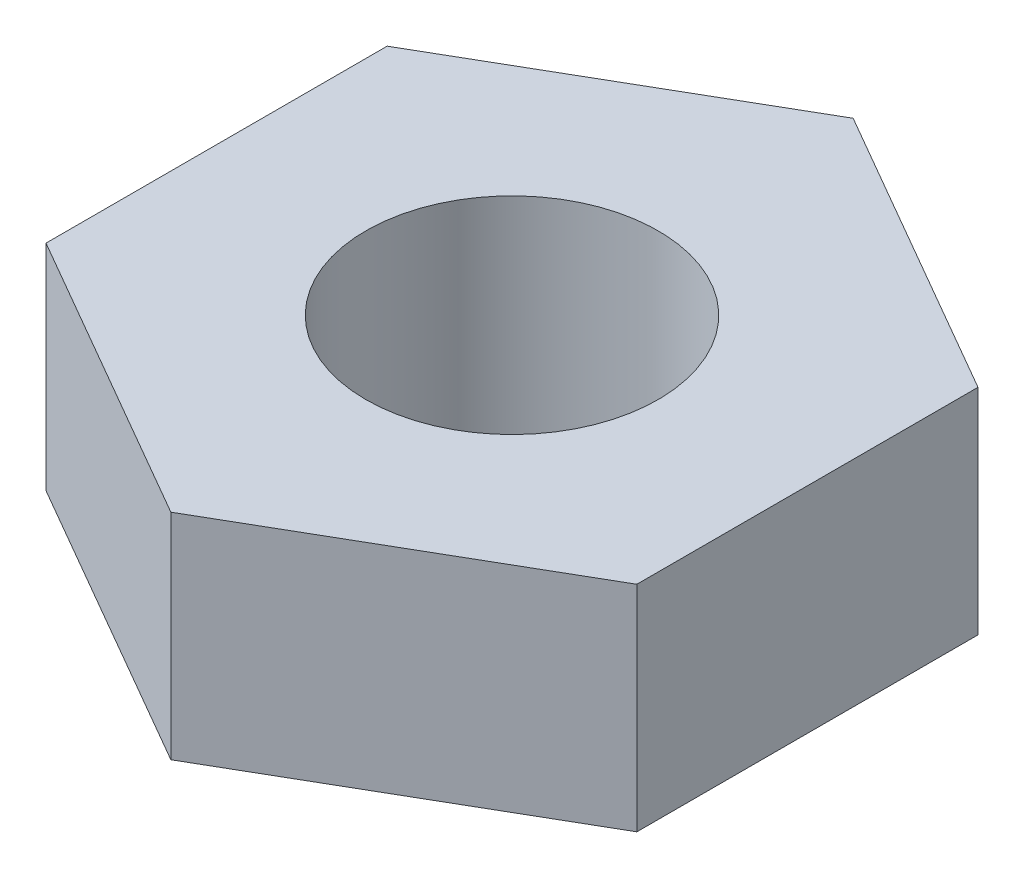
ISO-10303-21;
HEADER;
FILE_DESCRIPTION(('STEP AP214'),'2;1');
FILE_NAME('part.step','',(''),(''),'','','');
FILE_SCHEMA(('AUTOMOTIVE_DESIGN { 1 0 10303 214 1 1 1 1 }'));
ENDSEC;
DATA;
#1=APPLICATION_CONTEXT('core data for automotive mechanical design processes');
#2=APPLICATION_PROTOCOL_DEFINITION('international standard','automotive_design',2000,#1);
#3=PRODUCT_CONTEXT('',#1,'mechanical');
#4=PRODUCT('Part','Part','',(#3));
#5=PRODUCT_RELATED_PRODUCT_CATEGORY('part','',(#4));
#6=PRODUCT_DEFINITION_FORMATION('','',#4);
#7=PRODUCT_DEFINITION_CONTEXT('part definition',#1,'design');
#8=PRODUCT_DEFINITION('design','',#6,#7);
#9=PRODUCT_DEFINITION_SHAPE('','',#8);
#10=(LENGTH_UNIT() NAMED_UNIT(*) SI_UNIT(.MILLI.,.METRE.));
#11=(NAMED_UNIT(*) PLANE_ANGLE_UNIT() SI_UNIT($,.RADIAN.));
#12=(NAMED_UNIT(*) SI_UNIT($,.STERADIAN.) SOLID_ANGLE_UNIT());
#13=UNCERTAINTY_MEASURE_WITH_UNIT(LENGTH_MEASURE(1.E-05),#10,'distance_accuracy_value','');
#14=(GEOMETRIC_REPRESENTATION_CONTEXT(3) GLOBAL_UNCERTAINTY_ASSIGNED_CONTEXT((#13)) GLOBAL_UNIT_ASSIGNED_CONTEXT((#10,
#11,#12)) REPRESENTATION_CONTEXT('',''));
#15=CARTESIAN_POINT('',(0.,0.,0.));
#16=DIRECTION('',(0.,0.,1.));
#17=DIRECTION('',(1.,0.,0.));
#18=AXIS2_PLACEMENT_3D('',#15,#16,#17);
#19=CARTESIAN_POINT('',(-11.9500009809813,12.1,-11.0446978763615));
#20=DIRECTION('',(0.,1.,0.));
#21=DIRECTION('',(0.,0.,1.));
#22=AXIS2_PLACEMENT_3D('',#19,#20,#21);
#23=PLANE('',#22);
#24=DIRECTION('',(0.866025403784438,0.,-0.5));
#25=VECTOR('',#24,1.);
#26=CARTESIAN_POINT('',(-13.277778867757,12.1,-8.77188652929051));
#27=LINE('',#26,#25);
#28=CARTESIAN_POINT('',(-13.277778867757,12.1,-8.77188652929051));
#29=VERTEX_POINT('',#28);
#30=CARTESIAN_POINT('',(-10.2466899545114,12.1,-10.5218865292905));
#31=VERTEX_POINT('',#30);
#32=EDGE_CURVE('E132',#29,#31,#27,.T.);
#33=ORIENTED_EDGE('',*,*,#32,.T.);
#34=DIRECTION('',(0.,0.,-1.));
#35=VECTOR('',#34,1.);
#36=CARTESIAN_POINT('',(-10.2466899545114,12.1,-10.5218865292905));
#37=LINE('',#36,#35);
#38=CARTESIAN_POINT('',(-10.2466899545114,12.1,-14.0218865292905));
#39=VERTEX_POINT('',#38);
#40=EDGE_CURVE('E90',#31,#39,#37,.T.);
#41=ORIENTED_EDGE('',*,*,#40,.T.);
#42=DIRECTION('',(-0.866025403784439,0.,-0.5));
#43=VECTOR('',#42,1.);
#44=CARTESIAN_POINT('',(-10.2466899545114,12.1,-14.0218865292905));
#45=LINE('',#44,#43);
#46=CARTESIAN_POINT('',(-13.277778867757,12.1,-15.7718865292905));
#47=VERTEX_POINT('',#46);
#48=EDGE_CURVE('E103',#39,#47,#45,.T.);
#49=ORIENTED_EDGE('',*,*,#48,.T.);
#50=DIRECTION('',(-0.866025403784438,0.,0.5));
#51=VECTOR('',#50,1.);
#52=CARTESIAN_POINT('',(-13.277778867757,12.1,-15.7718865292905));
#53=LINE('',#52,#51);
#54=CARTESIAN_POINT('',(-16.3088677810025,12.1,-14.0218865292905));
#55=VERTEX_POINT('',#54);
#56=EDGE_CURVE('E97',#47,#55,#53,.T.);
#57=ORIENTED_EDGE('',*,*,#56,.T.);
#58=DIRECTION('',(0.,0.,1.));
#59=VECTOR('',#58,1.);
#60=CARTESIAN_POINT('',(-16.3088677810025,12.1,-14.0218865292905));
#61=LINE('',#60,#59);
#62=CARTESIAN_POINT('',(-16.3088677810025,12.1,-10.5218865292905));
#63=VERTEX_POINT('',#62);
#64=EDGE_CURVE('E101',#55,#63,#61,.T.);
#65=ORIENTED_EDGE('',*,*,#64,.T.);
#66=DIRECTION('',(0.866025403784439,0.,0.5));
#67=VECTOR('',#66,1.);
#68=CARTESIAN_POINT('',(-16.3088677810025,12.1,-10.5218865292905));
#69=LINE('',#68,#67);
#70=EDGE_CURVE('E53',#63,#29,#69,.T.);
#71=ORIENTED_EDGE('',*,*,#70,.T.);
#72=EDGE_LOOP('',(#33,#41,#49,#57,#65,#71));
#73=FACE_BOUND('',#72,.T.);
#74=CARTESIAN_POINT('',(-13.277778867757,12.1,-12.2718865292905));
#75=DIRECTION('',(0.,1.,0.));
#76=DIRECTION('',(0.,0.,1.));
#77=AXIS2_PLACEMENT_3D('',#74,#75,#76);
#78=CIRCLE('',#77,1.5);
#79=CARTESIAN_POINT('',(-13.277778867757,12.1,-10.7718865292905));
#80=VERTEX_POINT('',#79);
#81=EDGE_CURVE('E125',#80,#80,#78,.T.);
#82=ORIENTED_EDGE('',*,*,#81,.F.);
#83=EDGE_LOOP('',(#82));
#84=FACE_BOUND('',#83,.T.);
#85=ADVANCED_FACE('F36',(#73,#84),#23,.T.);
#86=CARTESIAN_POINT('',(-11.9500009809813,9.9,-11.0446978763615));
#87=DIRECTION('',(0.,1.,0.));
#88=DIRECTION('',(0.,0.,1.));
#89=AXIS2_PLACEMENT_3D('',#86,#87,#88);
#90=PLANE('',#89);
#91=DIRECTION('',(0.866025403784438,0.,-0.5));
#92=VECTOR('',#91,1.);
#93=CARTESIAN_POINT('',(-13.277778867757,9.9,-8.77188652929051));
#94=LINE('',#93,#92);
#95=CARTESIAN_POINT('',(-13.277778867757,9.9,-8.77188652929051));
#96=VERTEX_POINT('',#95);
#97=CARTESIAN_POINT('',(-10.2466899545114,9.9,-10.5218865292905));
#98=VERTEX_POINT('',#97);
#99=EDGE_CURVE('E121',#96,#98,#94,.T.);
#100=ORIENTED_EDGE('',*,*,#99,.F.);
#101=DIRECTION('',(0.866025403784439,0.,0.5));
#102=VECTOR('',#101,1.);
#103=CARTESIAN_POINT('',(-16.3088677810025,9.9,-10.5218865292905));
#104=LINE('',#103,#102);
#105=CARTESIAN_POINT('',(-16.3088677810025,9.9,-10.5218865292905));
#106=VERTEX_POINT('',#105);
#107=EDGE_CURVE('E82',#106,#96,#104,.T.);
#108=ORIENTED_EDGE('',*,*,#107,.F.);
#109=DIRECTION('',(0.,0.,1.));
#110=VECTOR('',#109,1.);
#111=CARTESIAN_POINT('',(-16.3088677810025,9.9,-14.0218865292905));
#112=LINE('',#111,#110);
#113=CARTESIAN_POINT('',(-16.3088677810025,9.9,-14.0218865292905));
#114=VERTEX_POINT('',#113);
#115=EDGE_CURVE('E76',#114,#106,#112,.T.);
#116=ORIENTED_EDGE('',*,*,#115,.F.);
#117=DIRECTION('',(-0.866025403784438,0.,0.5));
#118=VECTOR('',#117,1.);
#119=CARTESIAN_POINT('',(-13.277778867757,9.9,-15.7718865292905));
#120=LINE('',#119,#118);
#121=CARTESIAN_POINT('',(-13.277778867757,9.9,-15.7718865292905));
#122=VERTEX_POINT('',#121);
#123=EDGE_CURVE('E111',#122,#114,#120,.T.);
#124=ORIENTED_EDGE('',*,*,#123,.F.);
#125=DIRECTION('',(-0.866025403784439,0.,-0.5));
#126=VECTOR('',#125,1.);
#127=CARTESIAN_POINT('',(-10.2466899545114,9.9,-14.0218865292905));
#128=LINE('',#127,#126);
#129=CARTESIAN_POINT('',(-10.2466899545114,9.9,-14.0218865292905));
#130=VERTEX_POINT('',#129);
#131=EDGE_CURVE('E127',#130,#122,#128,.T.);
#132=ORIENTED_EDGE('',*,*,#131,.F.);
#133=DIRECTION('',(0.,0.,-1.));
#134=VECTOR('',#133,1.);
#135=CARTESIAN_POINT('',(-10.2466899545114,9.9,-10.5218865292905));
#136=LINE('',#135,#134);
#137=EDGE_CURVE('E124',#98,#130,#136,.T.);
#138=ORIENTED_EDGE('',*,*,#137,.F.);
#139=EDGE_LOOP('',(#100,#108,#116,#124,#132,#138));
#140=FACE_BOUND('',#139,.T.);
#141=CARTESIAN_POINT('',(-13.277778867757,9.9,-12.2718865292905));
#142=DIRECTION('',(0.,1.,0.));
#143=DIRECTION('',(0.,0.,1.));
#144=AXIS2_PLACEMENT_3D('',#141,#142,#143);
#145=CIRCLE('',#144,1.5);
#146=CARTESIAN_POINT('',(-13.277778867757,9.9,-10.7718865292905));
#147=VERTEX_POINT('',#146);
#148=EDGE_CURVE('E225',#147,#147,#145,.T.);
#149=ORIENTED_EDGE('',*,*,#148,.T.);
#150=EDGE_LOOP('',(#149));
#151=FACE_BOUND('',#150,.T.);
#152=ADVANCED_FACE('F141',(#140,#151),#90,.F.);
#153=CARTESIAN_POINT('',(-13.277778867757,12.1,-8.77188652929051));
#154=DIRECTION('',(-0.5,0.,-0.866025403784438));
#155=DIRECTION('',(-0.866025403784438,0.,0.5));
#156=AXIS2_PLACEMENT_3D('',#153,#154,#155);
#157=PLANE('',#156);
#158=ORIENTED_EDGE('',*,*,#99,.T.);
#159=DIRECTION('',(0.,-1.,0.));
#160=VECTOR('',#159,1.);
#161=CARTESIAN_POINT('',(-10.2466899545114,12.1,-10.5218865292905));
#162=LINE('',#161,#160);
#163=EDGE_CURVE('E11',#31,#98,#162,.T.);
#164=ORIENTED_EDGE('',*,*,#163,.F.);
#165=ORIENTED_EDGE('',*,*,#32,.F.);
#166=DIRECTION('',(0.,-1.,0.));
#167=VECTOR('',#166,1.);
#168=CARTESIAN_POINT('',(-13.277778867757,12.1,-8.77188652929051));
#169=LINE('',#168,#167);
#170=EDGE_CURVE('E117',#29,#96,#169,.T.);
#171=ORIENTED_EDGE('',*,*,#170,.T.);
#172=EDGE_LOOP('',(#158,#164,#165,#171));
#173=FACE_BOUND('',#172,.T.);
#174=ADVANCED_FACE('F38',(#173),#157,.F.);
#175=CARTESIAN_POINT('',(-10.2466899545114,12.1,-10.5218865292905));
#176=DIRECTION('',(-1.,0.,0.));
#177=DIRECTION('',(0.,0.,1.));
#178=AXIS2_PLACEMENT_3D('',#175,#176,#177);
#179=PLANE('',#178);
#180=ORIENTED_EDGE('',*,*,#137,.T.);
#181=DIRECTION('',(0.,-1.,0.));
#182=VECTOR('',#181,1.);
#183=CARTESIAN_POINT('',(-10.2466899545114,12.1,-14.0218865292905));
#184=LINE('',#183,#182);
#185=EDGE_CURVE('E45',#39,#130,#184,.T.);
#186=ORIENTED_EDGE('',*,*,#185,.F.);
#187=ORIENTED_EDGE('',*,*,#40,.F.);
#188=ORIENTED_EDGE('',*,*,#163,.T.);
#189=EDGE_LOOP('',(#180,#186,#187,#188));
#190=FACE_BOUND('',#189,.T.);
#191=ADVANCED_FACE('F166',(#190),#179,.F.);
#192=CARTESIAN_POINT('',(-10.2466899545114,12.1,-14.0218865292905));
#193=DIRECTION('',(-0.5,0.,0.866025403784439));
#194=DIRECTION('',(0.866025403784439,0.,0.5));
#195=AXIS2_PLACEMENT_3D('',#192,#193,#194);
#196=PLANE('',#195);
#197=ORIENTED_EDGE('',*,*,#131,.T.);
#198=DIRECTION('',(0.,-1.,0.));
#199=VECTOR('',#198,1.);
#200=CARTESIAN_POINT('',(-13.277778867757,12.1,-15.7718865292905));
#201=LINE('',#200,#199);
#202=EDGE_CURVE('E112',#47,#122,#201,.T.);
#203=ORIENTED_EDGE('',*,*,#202,.F.);
#204=ORIENTED_EDGE('',*,*,#48,.F.);
#205=ORIENTED_EDGE('',*,*,#185,.T.);
#206=EDGE_LOOP('',(#197,#203,#204,#205));
#207=FACE_BOUND('',#206,.T.);
#208=ADVANCED_FACE('F138',(#207),#196,.F.);
#209=CARTESIAN_POINT('',(-13.277778867757,12.1,-15.7718865292905));
#210=DIRECTION('',(0.500000000000001,0.,0.866025403784438));
#211=DIRECTION('',(0.866025403784438,0.,-0.500000000000001));
#212=AXIS2_PLACEMENT_3D('',#209,#210,#211);
#213=PLANE('',#212);
#214=ORIENTED_EDGE('',*,*,#123,.T.);
#215=DIRECTION('',(0.,-1.,0.));
#216=VECTOR('',#215,1.);
#217=CARTESIAN_POINT('',(-16.3088677810025,12.1,-14.0218865292905));
#218=LINE('',#217,#216);
#219=EDGE_CURVE('E108',#55,#114,#218,.T.);
#220=ORIENTED_EDGE('',*,*,#219,.F.);
#221=ORIENTED_EDGE('',*,*,#56,.F.);
#222=ORIENTED_EDGE('',*,*,#202,.T.);
#223=EDGE_LOOP('',(#214,#220,#221,#222));
#224=FACE_BOUND('',#223,.T.);
#225=ADVANCED_FACE('F109',(#224),#213,.F.);
#226=CARTESIAN_POINT('',(-16.3088677810025,12.1,-14.0218865292905));
#227=DIRECTION('',(1.,0.,0.));
#228=DIRECTION('',(0.,0.,-1.));
#229=AXIS2_PLACEMENT_3D('',#226,#227,#228);
#230=PLANE('',#229);
#231=ORIENTED_EDGE('',*,*,#115,.T.);
#232=DIRECTION('',(0.,-1.,0.));
#233=VECTOR('',#232,1.);
#234=CARTESIAN_POINT('',(-16.3088677810025,12.1,-10.5218865292905));
#235=LINE('',#234,#233);
#236=EDGE_CURVE('E113',#63,#106,#235,.T.);
#237=ORIENTED_EDGE('',*,*,#236,.F.);
#238=ORIENTED_EDGE('',*,*,#64,.F.);
#239=ORIENTED_EDGE('',*,*,#219,.T.);
#240=EDGE_LOOP('',(#231,#237,#238,#239));
#241=FACE_BOUND('',#240,.T.);
#242=ADVANCED_FACE('F115',(#241),#230,.F.);
#243=CARTESIAN_POINT('',(-16.3088677810025,12.1,-10.5218865292905));
#244=DIRECTION('',(0.5,0.,-0.866025403784439));
#245=DIRECTION('',(-0.866025403784439,0.,-0.5));
#246=AXIS2_PLACEMENT_3D('',#243,#244,#245);
#247=PLANE('',#246);
#248=ORIENTED_EDGE('',*,*,#107,.T.);
#249=ORIENTED_EDGE('',*,*,#170,.F.);
#250=ORIENTED_EDGE('',*,*,#70,.F.);
#251=ORIENTED_EDGE('',*,*,#236,.T.);
#252=EDGE_LOOP('',(#248,#249,#250,#251));
#253=FACE_BOUND('',#252,.T.);
#254=ADVANCED_FACE('F146',(#253),#247,.F.);
#255=CARTESIAN_POINT('',(-13.277778867757,12.1,-12.2718865292905));
#256=DIRECTION('',(0.,-1.,0.));
#257=DIRECTION('',(0.,0.,-1.));
#258=AXIS2_PLACEMENT_3D('',#255,#256,#257);
#259=CYLINDRICAL_SURFACE('',#258,1.5);
#260=ORIENTED_EDGE('',*,*,#81,.T.);
#261=EDGE_LOOP('',(#260));
#262=FACE_BOUND('',#261,.T.);
#263=ORIENTED_EDGE('',*,*,#148,.F.);
#264=EDGE_LOOP('',(#263));
#265=FACE_BOUND('',#264,.T.);
#266=ADVANCED_FACE('F148',(#262,#265),#259,.F.);
#267=CLOSED_SHELL('',(#85,#152,#174,#191,#208,#225,#242,#254,#266));
#268=MANIFOLD_SOLID_BREP('B2',#267);
#269=ADVANCED_BREP_SHAPE_REPRESENTATION('',(#18,#268),#14);
#270=SHAPE_DEFINITION_REPRESENTATION(#9,#269);
ENDSEC;
END-ISO-10303-21;
